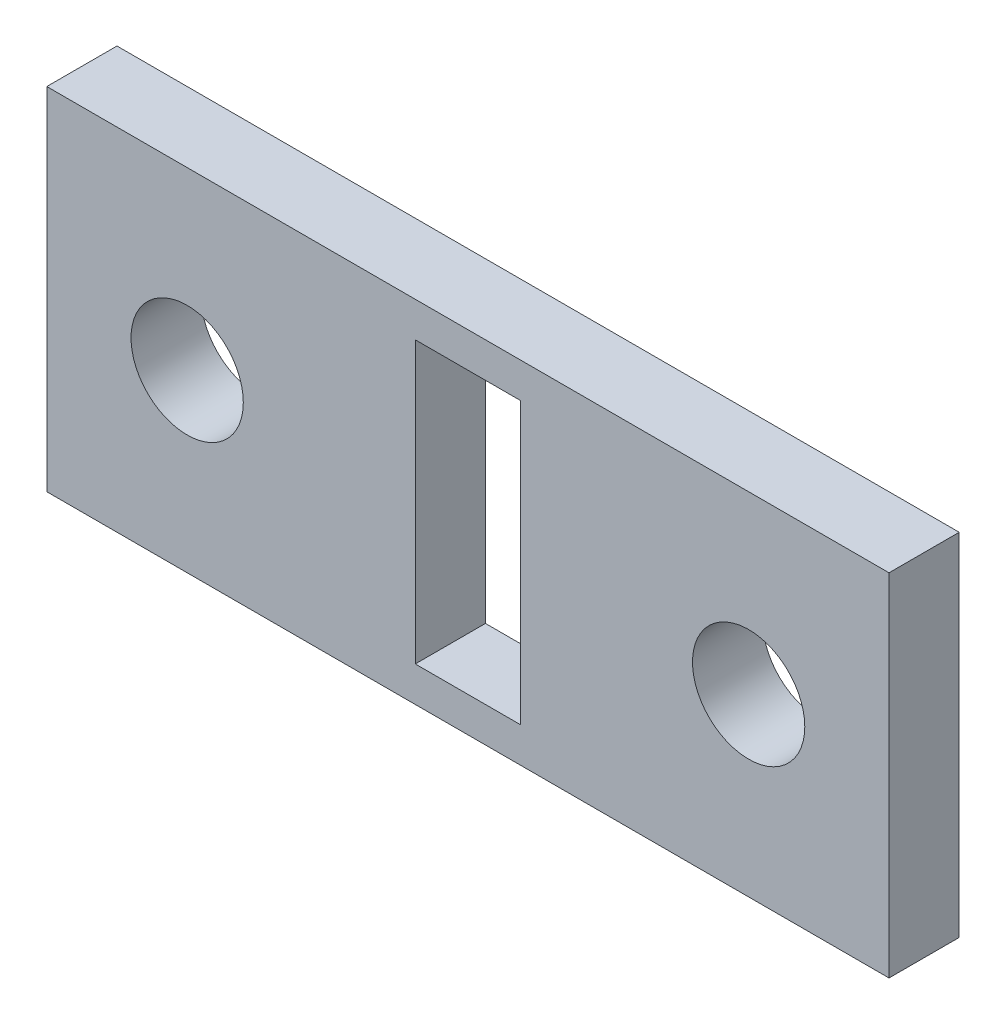
ISO-10303-21;
HEADER;
FILE_DESCRIPTION(('STEP AP214'),'2;1');
FILE_NAME('part.step','',(''),(''),'','','');
FILE_SCHEMA(('AUTOMOTIVE_DESIGN { 1 0 10303 214 1 1 1 1 }'));
ENDSEC;
DATA;
#1=APPLICATION_CONTEXT('core data for automotive mechanical design processes');
#2=APPLICATION_PROTOCOL_DEFINITION('international standard','automotive_design',2000,#1);
#3=PRODUCT_CONTEXT('',#1,'mechanical');
#4=PRODUCT('Part','Part','',(#3));
#5=PRODUCT_RELATED_PRODUCT_CATEGORY('part','',(#4));
#6=PRODUCT_DEFINITION_FORMATION('','',#4);
#7=PRODUCT_DEFINITION_CONTEXT('part definition',#1,'design');
#8=PRODUCT_DEFINITION('design','',#6,#7);
#9=PRODUCT_DEFINITION_SHAPE('','',#8);
#10=(LENGTH_UNIT() NAMED_UNIT(*) SI_UNIT(.MILLI.,.METRE.));
#11=(NAMED_UNIT(*) PLANE_ANGLE_UNIT() SI_UNIT($,.RADIAN.));
#12=(NAMED_UNIT(*) SI_UNIT($,.STERADIAN.) SOLID_ANGLE_UNIT());
#13=UNCERTAINTY_MEASURE_WITH_UNIT(LENGTH_MEASURE(1.E-05),#10,'distance_accuracy_value','');
#14=(GEOMETRIC_REPRESENTATION_CONTEXT(3) GLOBAL_UNCERTAINTY_ASSIGNED_CONTEXT((#13)) GLOBAL_UNIT_ASSIGNED_CONTEXT((#10,
#11,#12)) REPRESENTATION_CONTEXT('',''));
#15=CARTESIAN_POINT('',(0.,0.,0.));
#16=DIRECTION('',(0.,0.,1.));
#17=DIRECTION('',(1.,0.,0.));
#18=AXIS2_PLACEMENT_3D('',#15,#16,#17);
#19=CARTESIAN_POINT('',(0.,0.,2.));
#20=DIRECTION('',(1.,0.,0.));
#21=DIRECTION('',(0.,0.,-1.));
#22=AXIS2_PLACEMENT_3D('',#19,#20,#21);
#23=PLANE('',#22);
#24=DIRECTION('',(0.,-1.,0.));
#25=VECTOR('',#24,1.);
#26=CARTESIAN_POINT('',(0.,0.,0.));
#27=LINE('',#26,#25);
#28=CARTESIAN_POINT('',(0.,10.,0.));
#29=VERTEX_POINT('',#28);
#30=CARTESIAN_POINT('',(0.,0.,0.));
#31=VERTEX_POINT('',#30);
#32=EDGE_CURVE('E143',#29,#31,#27,.T.);
#33=ORIENTED_EDGE('',*,*,#32,.T.);
#34=DIRECTION('',(0.,0.,-1.));
#35=VECTOR('',#34,1.);
#36=CARTESIAN_POINT('',(0.,0.,2.));
#37=LINE('',#36,#35);
#38=CARTESIAN_POINT('',(0.,0.,2.));
#39=VERTEX_POINT('',#38);
#40=EDGE_CURVE('E11',#39,#31,#37,.T.);
#41=ORIENTED_EDGE('',*,*,#40,.F.);
#42=DIRECTION('',(0.,-1.,0.));
#43=VECTOR('',#42,1.);
#44=CARTESIAN_POINT('',(0.,0.,2.));
#45=LINE('',#44,#43);
#46=CARTESIAN_POINT('',(0.,10.,2.));
#47=VERTEX_POINT('',#46);
#48=EDGE_CURVE('E152',#47,#39,#45,.T.);
#49=ORIENTED_EDGE('',*,*,#48,.F.);
#50=DIRECTION('',(0.,0.,-1.));
#51=VECTOR('',#50,1.);
#52=CARTESIAN_POINT('',(0.,10.,2.));
#53=LINE('',#52,#51);
#54=EDGE_CURVE('E162',#47,#29,#53,.T.);
#55=ORIENTED_EDGE('',*,*,#54,.T.);
#56=EDGE_LOOP('',(#33,#41,#49,#55));
#57=FACE_BOUND('',#56,.T.);
#58=ADVANCED_FACE('F39',(#57),#23,.F.);
#59=CARTESIAN_POINT('',(0.,0.,2.));
#60=DIRECTION('',(0.,1.,0.));
#61=DIRECTION('',(0.,0.,1.));
#62=AXIS2_PLACEMENT_3D('',#59,#60,#61);
#63=PLANE('',#62);
#64=DIRECTION('',(1.,0.,0.));
#65=VECTOR('',#64,1.);
#66=CARTESIAN_POINT('',(0.,0.,0.));
#67=LINE('',#66,#65);
#68=CARTESIAN_POINT('',(24.,0.,0.));
#69=VERTEX_POINT('',#68);
#70=EDGE_CURVE('E165',#31,#69,#67,.T.);
#71=ORIENTED_EDGE('',*,*,#70,.T.);
#72=DIRECTION('',(0.,0.,-1.));
#73=VECTOR('',#72,1.);
#74=CARTESIAN_POINT('',(24.,0.,2.));
#75=LINE('',#74,#73);
#76=CARTESIAN_POINT('',(24.,0.,2.));
#77=VERTEX_POINT('',#76);
#78=EDGE_CURVE('E46',#77,#69,#75,.T.);
#79=ORIENTED_EDGE('',*,*,#78,.F.);
#80=DIRECTION('',(1.,0.,0.));
#81=VECTOR('',#80,1.);
#82=CARTESIAN_POINT('',(0.,0.,2.));
#83=LINE('',#82,#81);
#84=EDGE_CURVE('E155',#39,#77,#83,.T.);
#85=ORIENTED_EDGE('',*,*,#84,.F.);
#86=ORIENTED_EDGE('',*,*,#40,.T.);
#87=EDGE_LOOP('',(#71,#79,#85,#86));
#88=FACE_BOUND('',#87,.T.);
#89=ADVANCED_FACE('F194',(#88),#63,.F.);
#90=CARTESIAN_POINT('',(24.,0.,2.));
#91=DIRECTION('',(-1.,0.,0.));
#92=DIRECTION('',(0.,0.,1.));
#93=AXIS2_PLACEMENT_3D('',#90,#91,#92);
#94=PLANE('',#93);
#95=DIRECTION('',(0.,1.,0.));
#96=VECTOR('',#95,1.);
#97=CARTESIAN_POINT('',(24.,0.,0.));
#98=LINE('',#97,#96);
#99=CARTESIAN_POINT('',(24.,10.,0.));
#100=VERTEX_POINT('',#99);
#101=EDGE_CURVE('E167',#69,#100,#98,.T.);
#102=ORIENTED_EDGE('',*,*,#101,.T.);
#103=DIRECTION('',(0.,0.,-1.));
#104=VECTOR('',#103,1.);
#105=CARTESIAN_POINT('',(24.,10.,2.));
#106=LINE('',#105,#104);
#107=CARTESIAN_POINT('',(24.,10.,2.));
#108=VERTEX_POINT('',#107);
#109=EDGE_CURVE('E172',#108,#100,#106,.T.);
#110=ORIENTED_EDGE('',*,*,#109,.F.);
#111=DIRECTION('',(0.,1.,0.));
#112=VECTOR('',#111,1.);
#113=CARTESIAN_POINT('',(24.,0.,2.));
#114=LINE('',#113,#112);
#115=EDGE_CURVE('E158',#77,#108,#114,.T.);
#116=ORIENTED_EDGE('',*,*,#115,.F.);
#117=ORIENTED_EDGE('',*,*,#78,.T.);
#118=EDGE_LOOP('',(#102,#110,#116,#117));
#119=FACE_BOUND('',#118,.T.);
#120=ADVANCED_FACE('F179',(#119),#94,.F.);
#121=CARTESIAN_POINT('',(0.,10.,2.));
#122=DIRECTION('',(0.,-1.,0.));
#123=DIRECTION('',(0.,0.,-1.));
#124=AXIS2_PLACEMENT_3D('',#121,#122,#123);
#125=PLANE('',#124);
#126=DIRECTION('',(-1.,0.,0.));
#127=VECTOR('',#126,1.);
#128=CARTESIAN_POINT('',(0.,10.,0.));
#129=LINE('',#128,#127);
#130=EDGE_CURVE('E156',#100,#29,#129,.T.);
#131=ORIENTED_EDGE('',*,*,#130,.T.);
#132=ORIENTED_EDGE('',*,*,#54,.F.);
#133=DIRECTION('',(-1.,0.,0.));
#134=VECTOR('',#133,1.);
#135=CARTESIAN_POINT('',(0.,10.,2.));
#136=LINE('',#135,#134);
#137=EDGE_CURVE('E160',#108,#47,#136,.T.);
#138=ORIENTED_EDGE('',*,*,#137,.F.);
#139=ORIENTED_EDGE('',*,*,#109,.T.);
#140=EDGE_LOOP('',(#131,#132,#138,#139));
#141=FACE_BOUND('',#140,.T.);
#142=ADVANCED_FACE('F187',(#141),#125,.F.);
#143=CARTESIAN_POINT('',(0.,0.,2.));
#144=DIRECTION('',(0.,0.,-1.));
#145=DIRECTION('',(-1.,0.,0.));
#146=AXIS2_PLACEMENT_3D('',#143,#144,#145);
#147=PLANE('',#146);
#148=DIRECTION('',(1.,0.,0.));
#149=VECTOR('',#148,1.);
#150=CARTESIAN_POINT('',(10.5,1.,2.));
#151=LINE('',#150,#149);
#152=CARTESIAN_POINT('',(10.5,1.,2.));
#153=VERTEX_POINT('',#152);
#154=CARTESIAN_POINT('',(13.5,1.,2.));
#155=VERTEX_POINT('',#154);
#156=EDGE_CURVE('E130',#153,#155,#151,.T.);
#157=ORIENTED_EDGE('',*,*,#156,.F.);
#158=DIRECTION('',(0.,-1.,0.));
#159=VECTOR('',#158,1.);
#160=CARTESIAN_POINT('',(10.5,9.,2.));
#161=LINE('',#160,#159);
#162=CARTESIAN_POINT('',(10.5,9.,2.));
#163=VERTEX_POINT('',#162);
#164=EDGE_CURVE('E53',#163,#153,#161,.T.);
#165=ORIENTED_EDGE('',*,*,#164,.F.);
#166=DIRECTION('',(-1.,0.,0.));
#167=VECTOR('',#166,1.);
#168=CARTESIAN_POINT('',(10.5,9.,2.));
#169=LINE('',#168,#167);
#170=CARTESIAN_POINT('',(13.5,9.,2.));
#171=VERTEX_POINT('',#170);
#172=EDGE_CURVE('E121',#171,#163,#169,.T.);
#173=ORIENTED_EDGE('',*,*,#172,.F.);
#174=DIRECTION('',(0.,1.,0.));
#175=VECTOR('',#174,1.);
#176=CARTESIAN_POINT('',(13.5,9.,2.));
#177=LINE('',#176,#175);
#178=EDGE_CURVE('E124',#155,#171,#177,.T.);
#179=ORIENTED_EDGE('',*,*,#178,.F.);
#180=EDGE_LOOP('',(#157,#165,#173,#179));
#181=FACE_BOUND('',#180,.T.);
#182=CARTESIAN_POINT('',(4.,5.,2.));
#183=DIRECTION('',(0.,0.,1.));
#184=DIRECTION('',(1.,0.,0.));
#185=AXIS2_PLACEMENT_3D('',#182,#183,#184);
#186=CIRCLE('',#185,1.6);
#187=CARTESIAN_POINT('',(5.6,5.,2.));
#188=VERTEX_POINT('',#187);
#189=EDGE_CURVE('E144',#188,#188,#186,.T.);
#190=ORIENTED_EDGE('',*,*,#189,.F.);
#191=EDGE_LOOP('',(#190));
#192=FACE_BOUND('',#191,.T.);
#193=CARTESIAN_POINT('',(20.,5.,2.));
#194=DIRECTION('',(0.,0.,1.));
#195=DIRECTION('',(1.,0.,0.));
#196=AXIS2_PLACEMENT_3D('',#193,#194,#195);
#197=CIRCLE('',#196,1.6);
#198=CARTESIAN_POINT('',(21.6,5.,2.));
#199=VERTEX_POINT('',#198);
#200=EDGE_CURVE('E147',#199,#199,#197,.T.);
#201=ORIENTED_EDGE('',*,*,#200,.F.);
#202=EDGE_LOOP('',(#201));
#203=FACE_BOUND('',#202,.T.);
#204=ORIENTED_EDGE('',*,*,#48,.T.);
#205=ORIENTED_EDGE('',*,*,#84,.T.);
#206=ORIENTED_EDGE('',*,*,#115,.T.);
#207=ORIENTED_EDGE('',*,*,#137,.T.);
#208=EDGE_LOOP('',(#204,#205,#206,#207));
#209=FACE_BOUND('',#208,.T.);
#210=ADVANCED_FACE('F193',(#181,#192,#203,#209),#147,.F.);
#211=CARTESIAN_POINT('',(0.,0.,0.));
#212=DIRECTION('',(0.,0.,-1.));
#213=DIRECTION('',(-1.,0.,0.));
#214=AXIS2_PLACEMENT_3D('',#211,#212,#213);
#215=PLANE('',#214);
#216=DIRECTION('',(0.,-1.,0.));
#217=VECTOR('',#216,1.);
#218=CARTESIAN_POINT('',(10.5,9.,0.));
#219=LINE('',#218,#217);
#220=CARTESIAN_POINT('',(10.5,9.,0.));
#221=VERTEX_POINT('',#220);
#222=CARTESIAN_POINT('',(10.5,1.,0.));
#223=VERTEX_POINT('',#222);
#224=EDGE_CURVE('E105',#221,#223,#219,.T.);
#225=ORIENTED_EDGE('',*,*,#224,.T.);
#226=DIRECTION('',(1.,0.,0.));
#227=VECTOR('',#226,1.);
#228=CARTESIAN_POINT('',(10.5,1.,0.));
#229=LINE('',#228,#227);
#230=CARTESIAN_POINT('',(13.5,1.,0.));
#231=VERTEX_POINT('',#230);
#232=EDGE_CURVE('E114',#223,#231,#229,.T.);
#233=ORIENTED_EDGE('',*,*,#232,.T.);
#234=DIRECTION('',(0.,1.,0.));
#235=VECTOR('',#234,1.);
#236=CARTESIAN_POINT('',(13.5,9.,0.));
#237=LINE('',#236,#235);
#238=CARTESIAN_POINT('',(13.5,9.,0.));
#239=VERTEX_POINT('',#238);
#240=EDGE_CURVE('E61',#231,#239,#237,.T.);
#241=ORIENTED_EDGE('',*,*,#240,.T.);
#242=DIRECTION('',(-1.,0.,0.));
#243=VECTOR('',#242,1.);
#244=CARTESIAN_POINT('',(10.5,9.,0.));
#245=LINE('',#244,#243);
#246=EDGE_CURVE('E111',#239,#221,#245,.T.);
#247=ORIENTED_EDGE('',*,*,#246,.T.);
#248=EDGE_LOOP('',(#225,#233,#241,#247));
#249=FACE_BOUND('',#248,.T.);
#250=CARTESIAN_POINT('',(4.,5.,0.));
#251=DIRECTION('',(0.,0.,1.));
#252=DIRECTION('',(1.,0.,0.));
#253=AXIS2_PLACEMENT_3D('',#250,#251,#252);
#254=CIRCLE('',#253,1.6);
#255=CARTESIAN_POINT('',(5.6,5.,0.));
#256=VERTEX_POINT('',#255);
#257=EDGE_CURVE('E140',#256,#256,#254,.T.);
#258=ORIENTED_EDGE('',*,*,#257,.T.);
#259=EDGE_LOOP('',(#258));
#260=FACE_BOUND('',#259,.T.);
#261=CARTESIAN_POINT('',(20.,5.,0.));
#262=DIRECTION('',(0.,0.,1.));
#263=DIRECTION('',(1.,0.,0.));
#264=AXIS2_PLACEMENT_3D('',#261,#262,#263);
#265=CIRCLE('',#264,1.6);
#266=CARTESIAN_POINT('',(21.6,5.,0.));
#267=VERTEX_POINT('',#266);
#268=EDGE_CURVE('E136',#267,#267,#265,.T.);
#269=ORIENTED_EDGE('',*,*,#268,.T.);
#270=EDGE_LOOP('',(#269));
#271=FACE_BOUND('',#270,.T.);
#272=ORIENTED_EDGE('',*,*,#32,.F.);
#273=ORIENTED_EDGE('',*,*,#130,.F.);
#274=ORIENTED_EDGE('',*,*,#101,.F.);
#275=ORIENTED_EDGE('',*,*,#70,.F.);
#276=EDGE_LOOP('',(#272,#273,#274,#275));
#277=FACE_BOUND('',#276,.T.);
#278=ADVANCED_FACE('F118',(#249,#260,#271,#277),#215,.T.);
#279=CARTESIAN_POINT('',(20.,5.,0.));
#280=DIRECTION('',(0.,0.,1.));
#281=DIRECTION('',(1.,0.,0.));
#282=AXIS2_PLACEMENT_3D('',#279,#280,#281);
#283=CYLINDRICAL_SURFACE('',#282,1.6);
#284=ORIENTED_EDGE('',*,*,#268,.F.);
#285=EDGE_LOOP('',(#284));
#286=FACE_BOUND('',#285,.T.);
#287=ORIENTED_EDGE('',*,*,#200,.T.);
#288=EDGE_LOOP('',(#287));
#289=FACE_BOUND('',#288,.T.);
#290=ADVANCED_FACE('F206',(#286,#289),#283,.F.);
#291=CARTESIAN_POINT('',(4.,5.,0.));
#292=DIRECTION('',(0.,0.,1.));
#293=DIRECTION('',(1.,0.,0.));
#294=AXIS2_PLACEMENT_3D('',#291,#292,#293);
#295=CYLINDRICAL_SURFACE('',#294,1.6);
#296=ORIENTED_EDGE('',*,*,#257,.F.);
#297=EDGE_LOOP('',(#296));
#298=FACE_BOUND('',#297,.T.);
#299=ORIENTED_EDGE('',*,*,#189,.T.);
#300=EDGE_LOOP('',(#299));
#301=FACE_BOUND('',#300,.T.);
#302=ADVANCED_FACE('F212',(#298,#301),#295,.F.);
#303=CARTESIAN_POINT('',(10.5,9.,0.));
#304=DIRECTION('',(-1.,0.,0.));
#305=DIRECTION('',(0.,-1.,0.));
#306=AXIS2_PLACEMENT_3D('',#303,#304,#305);
#307=PLANE('',#306);
#308=ORIENTED_EDGE('',*,*,#164,.T.);
#309=DIRECTION('',(0.,0.,1.));
#310=VECTOR('',#309,1.);
#311=CARTESIAN_POINT('',(10.5,1.,0.));
#312=LINE('',#311,#310);
#313=EDGE_CURVE('E101',#223,#153,#312,.T.);
#314=ORIENTED_EDGE('',*,*,#313,.F.);
#315=ORIENTED_EDGE('',*,*,#224,.F.);
#316=DIRECTION('',(0.,0.,1.));
#317=VECTOR('',#316,1.);
#318=CARTESIAN_POINT('',(10.5,9.,0.));
#319=LINE('',#318,#317);
#320=EDGE_CURVE('E134',#221,#163,#319,.T.);
#321=ORIENTED_EDGE('',*,*,#320,.T.);
#322=EDGE_LOOP('',(#308,#314,#315,#321));
#323=FACE_BOUND('',#322,.T.);
#324=ADVANCED_FACE('F103',(#323),#307,.F.);
#325=CARTESIAN_POINT('',(10.5,9.,0.));
#326=DIRECTION('',(0.,1.,0.));
#327=DIRECTION('',(0.,0.,1.));
#328=AXIS2_PLACEMENT_3D('',#325,#326,#327);
#329=PLANE('',#328);
#330=ORIENTED_EDGE('',*,*,#172,.T.);
#331=ORIENTED_EDGE('',*,*,#320,.F.);
#332=ORIENTED_EDGE('',*,*,#246,.F.);
#333=DIRECTION('',(0.,0.,1.));
#334=VECTOR('',#333,1.);
#335=CARTESIAN_POINT('',(13.5,9.,0.));
#336=LINE('',#335,#334);
#337=EDGE_CURVE('E137',#239,#171,#336,.T.);
#338=ORIENTED_EDGE('',*,*,#337,.T.);
#339=EDGE_LOOP('',(#330,#331,#332,#338));
#340=FACE_BOUND('',#339,.T.);
#341=ADVANCED_FACE('F219',(#340),#329,.F.);
#342=CARTESIAN_POINT('',(13.5,9.,0.));
#343=DIRECTION('',(1.,0.,0.));
#344=DIRECTION('',(0.,1.,0.));
#345=AXIS2_PLACEMENT_3D('',#342,#343,#344);
#346=PLANE('',#345);
#347=ORIENTED_EDGE('',*,*,#178,.T.);
#348=ORIENTED_EDGE('',*,*,#337,.F.);
#349=ORIENTED_EDGE('',*,*,#240,.F.);
#350=DIRECTION('',(0.,0.,1.));
#351=VECTOR('',#350,1.);
#352=CARTESIAN_POINT('',(13.5,1.,0.));
#353=LINE('',#352,#351);
#354=EDGE_CURVE('E110',#231,#155,#353,.T.);
#355=ORIENTED_EDGE('',*,*,#354,.T.);
#356=EDGE_LOOP('',(#347,#348,#349,#355));
#357=FACE_BOUND('',#356,.T.);
#358=ADVANCED_FACE('F222',(#357),#346,.F.);
#359=CARTESIAN_POINT('',(10.5,1.,0.));
#360=DIRECTION('',(0.,-1.,0.));
#361=DIRECTION('',(0.,0.,-1.));
#362=AXIS2_PLACEMENT_3D('',#359,#360,#361);
#363=PLANE('',#362);
#364=ORIENTED_EDGE('',*,*,#156,.T.);
#365=ORIENTED_EDGE('',*,*,#354,.F.);
#366=ORIENTED_EDGE('',*,*,#232,.F.);
#367=ORIENTED_EDGE('',*,*,#313,.T.);
#368=EDGE_LOOP('',(#364,#365,#366,#367));
#369=FACE_BOUND('',#368,.T.);
#370=ADVANCED_FACE('F115',(#369),#363,.F.);
#371=CLOSED_SHELL('',(#58,#89,#120,#142,#210,#278,#290,#302,#324,#341,#358,#370));
#372=MANIFOLD_SOLID_BREP('B2',#371);
#373=ADVANCED_BREP_SHAPE_REPRESENTATION('',(#18,#372),#14);
#374=SHAPE_DEFINITION_REPRESENTATION(#9,#373);
ENDSEC;
END-ISO-10303-21;
